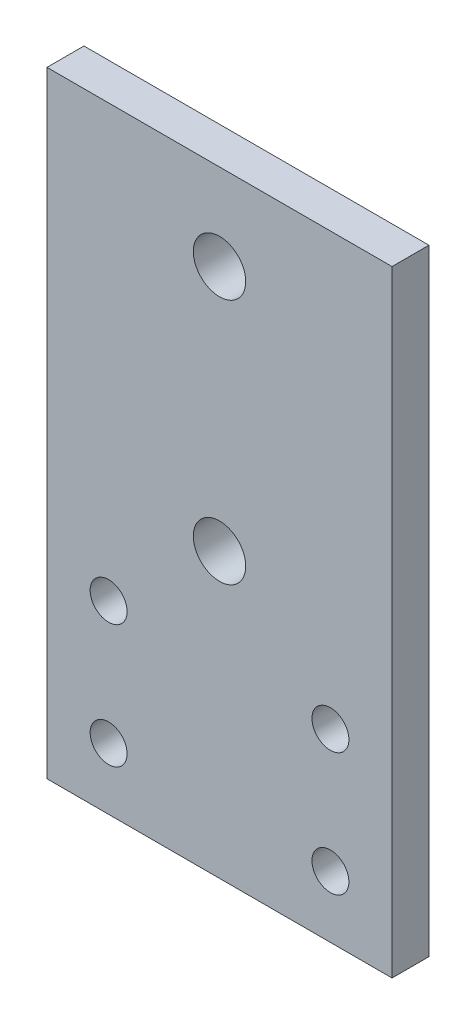
ISO-10303-21;
HEADER;
FILE_DESCRIPTION(('STEP AP214'),'2;1');
FILE_NAME('part.step','',(''),(''),'','','');
FILE_SCHEMA(('AUTOMOTIVE_DESIGN { 1 0 10303 214 1 1 1 1 }'));
ENDSEC;
DATA;
#1=APPLICATION_CONTEXT('core data for automotive mechanical design processes');
#2=APPLICATION_PROTOCOL_DEFINITION('international standard','automotive_design',2000,#1);
#3=PRODUCT_CONTEXT('',#1,'mechanical');
#4=PRODUCT('Part','Part','',(#3));
#5=PRODUCT_RELATED_PRODUCT_CATEGORY('part','',(#4));
#6=PRODUCT_DEFINITION_FORMATION('','',#4);
#7=PRODUCT_DEFINITION_CONTEXT('part definition',#1,'design');
#8=PRODUCT_DEFINITION('design','',#6,#7);
#9=PRODUCT_DEFINITION_SHAPE('','',#8);
#10=(LENGTH_UNIT() NAMED_UNIT(*) SI_UNIT(.MILLI.,.METRE.));
#11=(NAMED_UNIT(*) PLANE_ANGLE_UNIT() SI_UNIT($,.RADIAN.));
#12=(NAMED_UNIT(*) SI_UNIT($,.STERADIAN.) SOLID_ANGLE_UNIT());
#13=UNCERTAINTY_MEASURE_WITH_UNIT(LENGTH_MEASURE(1.E-05),#10,'distance_accuracy_value','');
#14=(GEOMETRIC_REPRESENTATION_CONTEXT(3) GLOBAL_UNCERTAINTY_ASSIGNED_CONTEXT((#13)) GLOBAL_UNIT_ASSIGNED_CONTEXT((#10,
#11,#12)) REPRESENTATION_CONTEXT('',''));
#15=CARTESIAN_POINT('',(0.,0.,0.));
#16=DIRECTION('',(0.,0.,1.));
#17=DIRECTION('',(1.,0.,0.));
#18=AXIS2_PLACEMENT_3D('',#15,#16,#17);
#19=CARTESIAN_POINT('',(0.,0.,3.));
#20=DIRECTION('',(0.,0.,-1.));
#21=DIRECTION('',(-1.,0.,0.));
#22=AXIS2_PLACEMENT_3D('',#19,#20,#21);
#23=PLANE('',#22);
#24=DIRECTION('',(0.,1.,0.));
#25=VECTOR('',#24,1.);
#26=CARTESIAN_POINT('',(14.,-25.,3.));
#27=LINE('',#26,#25);
#28=CARTESIAN_POINT('',(14.,-25.,3.));
#29=VERTEX_POINT('',#28);
#30=CARTESIAN_POINT('',(14.,25.,3.));
#31=VERTEX_POINT('',#30);
#32=EDGE_CURVE('E85',#29,#31,#27,.T.);
#33=ORIENTED_EDGE('',*,*,#32,.T.);
#34=DIRECTION('',(-1.,0.,0.));
#35=VECTOR('',#34,1.);
#36=CARTESIAN_POINT('',(-14.,25.,3.));
#37=LINE('',#36,#35);
#38=CARTESIAN_POINT('',(-14.,25.,3.));
#39=VERTEX_POINT('',#38);
#40=EDGE_CURVE('E80',#31,#39,#37,.T.);
#41=ORIENTED_EDGE('',*,*,#40,.T.);
#42=DIRECTION('',(0.,-1.,0.));
#43=VECTOR('',#42,1.);
#44=CARTESIAN_POINT('',(-14.,-25.,3.));
#45=LINE('',#44,#43);
#46=CARTESIAN_POINT('',(-14.,-25.,3.));
#47=VERTEX_POINT('',#46);
#48=EDGE_CURVE('E83',#39,#47,#45,.T.);
#49=ORIENTED_EDGE('',*,*,#48,.T.);
#50=DIRECTION('',(1.,0.,0.));
#51=VECTOR('',#50,1.);
#52=CARTESIAN_POINT('',(-14.,-25.,3.));
#53=LINE('',#52,#51);
#54=EDGE_CURVE('E50',#47,#29,#53,.T.);
#55=ORIENTED_EDGE('',*,*,#54,.T.);
#56=EDGE_LOOP('',(#33,#41,#49,#55));
#57=FACE_BOUND('',#56,.T.);
#58=CARTESIAN_POINT('',(0.,18.,3.));
#59=DIRECTION('',(0.,0.,1.));
#60=DIRECTION('',(1.,0.,0.));
#61=AXIS2_PLACEMENT_3D('',#58,#59,#60);
#62=CIRCLE('',#61,2.125);
#63=CARTESIAN_POINT('',(2.125,18.,3.));
#64=VERTEX_POINT('',#63);
#65=EDGE_CURVE('E100',#64,#64,#62,.T.);
#66=ORIENTED_EDGE('',*,*,#65,.F.);
#67=EDGE_LOOP('',(#66));
#68=FACE_BOUND('',#67,.T.);
#69=CARTESIAN_POINT('',(0.,-1.99999999999999,3.));
#70=DIRECTION('',(0.,0.,1.));
#71=DIRECTION('',(1.,0.,0.));
#72=AXIS2_PLACEMENT_3D('',#69,#70,#71);
#73=CIRCLE('',#72,2.125);
#74=CARTESIAN_POINT('',(2.125,-1.99999999999999,3.));
#75=VERTEX_POINT('',#74);
#76=EDGE_CURVE('E115',#75,#75,#73,.T.);
#77=ORIENTED_EDGE('',*,*,#76,.F.);
#78=EDGE_LOOP('',(#77));
#79=FACE_BOUND('',#78,.T.);
#80=CARTESIAN_POINT('',(-8.99999999999999,-10.,3.));
#81=DIRECTION('',(0.,0.,1.));
#82=DIRECTION('',(1.,0.,0.));
#83=AXIS2_PLACEMENT_3D('',#80,#81,#82);
#84=CIRCLE('',#83,1.5);
#85=CARTESIAN_POINT('',(-7.49999999999999,-10.,3.));
#86=VERTEX_POINT('',#85);
#87=EDGE_CURVE('E121',#86,#86,#84,.T.);
#88=ORIENTED_EDGE('',*,*,#87,.F.);
#89=EDGE_LOOP('',(#88));
#90=FACE_BOUND('',#89,.T.);
#91=CARTESIAN_POINT('',(-8.99999999999999,-20.,3.));
#92=DIRECTION('',(0.,0.,1.));
#93=DIRECTION('',(1.,0.,0.));
#94=AXIS2_PLACEMENT_3D('',#91,#92,#93);
#95=CIRCLE('',#94,1.5);
#96=CARTESIAN_POINT('',(-7.49999999999999,-20.,3.));
#97=VERTEX_POINT('',#96);
#98=EDGE_CURVE('E127',#97,#97,#95,.T.);
#99=ORIENTED_EDGE('',*,*,#98,.F.);
#100=EDGE_LOOP('',(#99));
#101=FACE_BOUND('',#100,.T.);
#102=CARTESIAN_POINT('',(9.,-20.,3.));
#103=DIRECTION('',(0.,0.,1.));
#104=DIRECTION('',(-1.,0.,0.));
#105=AXIS2_PLACEMENT_3D('',#102,#103,#104);
#106=CIRCLE('',#105,1.5);
#107=CARTESIAN_POINT('',(7.5,-20.,3.));
#108=VERTEX_POINT('',#107);
#109=EDGE_CURVE('E133',#108,#108,#106,.T.);
#110=ORIENTED_EDGE('',*,*,#109,.F.);
#111=EDGE_LOOP('',(#110));
#112=FACE_BOUND('',#111,.T.);
#113=CARTESIAN_POINT('',(9.,-10.,3.));
#114=DIRECTION('',(0.,0.,1.));
#115=DIRECTION('',(-1.,0.,0.));
#116=AXIS2_PLACEMENT_3D('',#113,#114,#115);
#117=CIRCLE('',#116,1.5);
#118=CARTESIAN_POINT('',(7.5,-10.,3.));
#119=VERTEX_POINT('',#118);
#120=EDGE_CURVE('E139',#119,#119,#117,.T.);
#121=ORIENTED_EDGE('',*,*,#120,.F.);
#122=EDGE_LOOP('',(#121));
#123=FACE_BOUND('',#122,.T.);
#124=ADVANCED_FACE('F33',(#57,#68,#79,#90,#101,#112,#123),#23,.F.);
#125=CARTESIAN_POINT('',(0.,0.,0.));
#126=DIRECTION('',(0.,0.,-1.));
#127=DIRECTION('',(-1.,0.,0.));
#128=AXIS2_PLACEMENT_3D('',#125,#126,#127);
#129=PLANE('',#128);
#130=CARTESIAN_POINT('',(9.,-20.,0.));
#131=DIRECTION('',(0.,0.,1.));
#132=DIRECTION('',(-1.,0.,0.));
#133=AXIS2_PLACEMENT_3D('',#130,#131,#132);
#134=CIRCLE('',#133,1.5);
#135=CARTESIAN_POINT('',(7.5,-20.,0.));
#136=VERTEX_POINT('',#135);
#137=EDGE_CURVE('E136',#136,#136,#134,.T.);
#138=ORIENTED_EDGE('',*,*,#137,.T.);
#139=EDGE_LOOP('',(#138));
#140=FACE_BOUND('',#139,.T.);
#141=CARTESIAN_POINT('',(-8.99999999999999,-10.,0.));
#142=DIRECTION('',(0.,0.,1.));
#143=DIRECTION('',(1.,0.,0.));
#144=AXIS2_PLACEMENT_3D('',#141,#142,#143);
#145=CIRCLE('',#144,1.5);
#146=CARTESIAN_POINT('',(-7.49999999999999,-10.,0.));
#147=VERTEX_POINT('',#146);
#148=EDGE_CURVE('E124',#147,#147,#145,.T.);
#149=ORIENTED_EDGE('',*,*,#148,.T.);
#150=EDGE_LOOP('',(#149));
#151=FACE_BOUND('',#150,.T.);
#152=CARTESIAN_POINT('',(0.,18.,0.));
#153=DIRECTION('',(0.,0.,1.));
#154=DIRECTION('',(1.,0.,0.));
#155=AXIS2_PLACEMENT_3D('',#152,#153,#154);
#156=CIRCLE('',#155,2.125);
#157=CARTESIAN_POINT('',(2.125,18.,0.));
#158=VERTEX_POINT('',#157);
#159=EDGE_CURVE('E112',#158,#158,#156,.T.);
#160=ORIENTED_EDGE('',*,*,#159,.T.);
#161=EDGE_LOOP('',(#160));
#162=FACE_BOUND('',#161,.T.);
#163=DIRECTION('',(0.,1.,0.));
#164=VECTOR('',#163,1.);
#165=CARTESIAN_POINT('',(14.,-25.,0.));
#166=LINE('',#165,#164);
#167=CARTESIAN_POINT('',(14.,-25.,0.));
#168=VERTEX_POINT('',#167);
#169=CARTESIAN_POINT('',(14.,25.,0.));
#170=VERTEX_POINT('',#169);
#171=EDGE_CURVE('E97',#168,#170,#166,.T.);
#172=ORIENTED_EDGE('',*,*,#171,.F.);
#173=DIRECTION('',(1.,0.,0.));
#174=VECTOR('',#173,1.);
#175=CARTESIAN_POINT('',(-14.,-25.,0.));
#176=LINE('',#175,#174);
#177=CARTESIAN_POINT('',(-14.,-25.,0.));
#178=VERTEX_POINT('',#177);
#179=EDGE_CURVE('E73',#178,#168,#176,.T.);
#180=ORIENTED_EDGE('',*,*,#179,.F.);
#181=DIRECTION('',(0.,-1.,0.));
#182=VECTOR('',#181,1.);
#183=CARTESIAN_POINT('',(-14.,-25.,0.));
#184=LINE('',#183,#182);
#185=CARTESIAN_POINT('',(-14.,25.,0.));
#186=VERTEX_POINT('',#185);
#187=EDGE_CURVE('E67',#186,#178,#184,.T.);
#188=ORIENTED_EDGE('',*,*,#187,.F.);
#189=DIRECTION('',(-1.,0.,0.));
#190=VECTOR('',#189,1.);
#191=CARTESIAN_POINT('',(-14.,25.,0.));
#192=LINE('',#191,#190);
#193=EDGE_CURVE('E89',#170,#186,#192,.T.);
#194=ORIENTED_EDGE('',*,*,#193,.F.);
#195=EDGE_LOOP('',(#172,#180,#188,#194));
#196=FACE_BOUND('',#195,.T.);
#197=CARTESIAN_POINT('',(0.,-1.99999999999999,0.));
#198=DIRECTION('',(0.,0.,1.));
#199=DIRECTION('',(1.,0.,0.));
#200=AXIS2_PLACEMENT_3D('',#197,#198,#199);
#201=CIRCLE('',#200,2.125);
#202=CARTESIAN_POINT('',(2.125,-1.99999999999999,0.));
#203=VERTEX_POINT('',#202);
#204=EDGE_CURVE('E118',#203,#203,#201,.T.);
#205=ORIENTED_EDGE('',*,*,#204,.T.);
#206=EDGE_LOOP('',(#205));
#207=FACE_BOUND('',#206,.T.);
#208=CARTESIAN_POINT('',(-8.99999999999999,-20.,0.));
#209=DIRECTION('',(0.,0.,1.));
#210=DIRECTION('',(1.,0.,0.));
#211=AXIS2_PLACEMENT_3D('',#208,#209,#210);
#212=CIRCLE('',#211,1.5);
#213=CARTESIAN_POINT('',(-7.49999999999999,-20.,0.));
#214=VERTEX_POINT('',#213);
#215=EDGE_CURVE('E130',#214,#214,#212,.T.);
#216=ORIENTED_EDGE('',*,*,#215,.T.);
#217=EDGE_LOOP('',(#216));
#218=FACE_BOUND('',#217,.T.);
#219=CARTESIAN_POINT('',(9.,-10.,0.));
#220=DIRECTION('',(0.,0.,1.));
#221=DIRECTION('',(-1.,0.,0.));
#222=AXIS2_PLACEMENT_3D('',#219,#220,#221);
#223=CIRCLE('',#222,1.5);
#224=CARTESIAN_POINT('',(7.5,-10.,0.));
#225=VERTEX_POINT('',#224);
#226=EDGE_CURVE('E142',#225,#225,#223,.T.);
#227=ORIENTED_EDGE('',*,*,#226,.T.);
#228=EDGE_LOOP('',(#227));
#229=FACE_BOUND('',#228,.T.);
#230=ADVANCED_FACE('F108',(#140,#151,#162,#196,#207,#218,#229),#129,.T.);
#231=CARTESIAN_POINT('',(14.,-25.,3.));
#232=DIRECTION('',(-1.,0.,0.));
#233=DIRECTION('',(0.,0.,1.));
#234=AXIS2_PLACEMENT_3D('',#231,#232,#233);
#235=PLANE('',#234);
#236=ORIENTED_EDGE('',*,*,#171,.T.);
#237=DIRECTION('',(0.,0.,-1.));
#238=VECTOR('',#237,1.);
#239=CARTESIAN_POINT('',(14.,25.,3.));
#240=LINE('',#239,#238);
#241=EDGE_CURVE('E11',#31,#170,#240,.T.);
#242=ORIENTED_EDGE('',*,*,#241,.F.);
#243=ORIENTED_EDGE('',*,*,#32,.F.);
#244=DIRECTION('',(0.,0.,-1.));
#245=VECTOR('',#244,1.);
#246=CARTESIAN_POINT('',(14.,-25.,3.));
#247=LINE('',#246,#245);
#248=EDGE_CURVE('E93',#29,#168,#247,.T.);
#249=ORIENTED_EDGE('',*,*,#248,.T.);
#250=EDGE_LOOP('',(#236,#242,#243,#249));
#251=FACE_BOUND('',#250,.T.);
#252=ADVANCED_FACE('F35',(#251),#235,.F.);
#253=CARTESIAN_POINT('',(-14.,25.,3.));
#254=DIRECTION('',(0.,-1.,0.));
#255=DIRECTION('',(0.,0.,-1.));
#256=AXIS2_PLACEMENT_3D('',#253,#254,#255);
#257=PLANE('',#256);
#258=ORIENTED_EDGE('',*,*,#193,.T.);
#259=DIRECTION('',(0.,0.,-1.));
#260=VECTOR('',#259,1.);
#261=CARTESIAN_POINT('',(-14.,25.,3.));
#262=LINE('',#261,#260);
#263=EDGE_CURVE('E42',#39,#186,#262,.T.);
#264=ORIENTED_EDGE('',*,*,#263,.F.);
#265=ORIENTED_EDGE('',*,*,#40,.F.);
#266=ORIENTED_EDGE('',*,*,#241,.T.);
#267=EDGE_LOOP('',(#258,#264,#265,#266));
#268=FACE_BOUND('',#267,.T.);
#269=ADVANCED_FACE('F88',(#268),#257,.F.);
#270=CARTESIAN_POINT('',(-14.,-25.,3.));
#271=DIRECTION('',(1.,0.,0.));
#272=DIRECTION('',(0.,0.,-1.));
#273=AXIS2_PLACEMENT_3D('',#270,#271,#272);
#274=PLANE('',#273);
#275=ORIENTED_EDGE('',*,*,#187,.T.);
#276=DIRECTION('',(0.,0.,-1.));
#277=VECTOR('',#276,1.);
#278=CARTESIAN_POINT('',(-14.,-25.,3.));
#279=LINE('',#278,#277);
#280=EDGE_CURVE('E90',#47,#178,#279,.T.);
#281=ORIENTED_EDGE('',*,*,#280,.F.);
#282=ORIENTED_EDGE('',*,*,#48,.F.);
#283=ORIENTED_EDGE('',*,*,#263,.T.);
#284=EDGE_LOOP('',(#275,#281,#282,#283));
#285=FACE_BOUND('',#284,.T.);
#286=ADVANCED_FACE('F91',(#285),#274,.F.);
#287=CARTESIAN_POINT('',(-14.,-25.,3.));
#288=DIRECTION('',(0.,1.,0.));
#289=DIRECTION('',(0.,0.,1.));
#290=AXIS2_PLACEMENT_3D('',#287,#288,#289);
#291=PLANE('',#290);
#292=ORIENTED_EDGE('',*,*,#179,.T.);
#293=ORIENTED_EDGE('',*,*,#248,.F.);
#294=ORIENTED_EDGE('',*,*,#54,.F.);
#295=ORIENTED_EDGE('',*,*,#280,.T.);
#296=EDGE_LOOP('',(#292,#293,#294,#295));
#297=FACE_BOUND('',#296,.T.);
#298=ADVANCED_FACE('F105',(#297),#291,.F.);
#299=CARTESIAN_POINT('',(0.,18.,3.));
#300=DIRECTION('',(0.,0.,-1.));
#301=DIRECTION('',(-1.,0.,0.));
#302=AXIS2_PLACEMENT_3D('',#299,#300,#301);
#303=CYLINDRICAL_SURFACE('',#302,2.125);
#304=ORIENTED_EDGE('',*,*,#65,.T.);
#305=EDGE_LOOP('',(#304));
#306=FACE_BOUND('',#305,.T.);
#307=ORIENTED_EDGE('',*,*,#159,.F.);
#308=EDGE_LOOP('',(#307));
#309=FACE_BOUND('',#308,.T.);
#310=ADVANCED_FACE('F159',(#306,#309),#303,.F.);
#311=CARTESIAN_POINT('',(0.,-1.99999999999999,3.));
#312=DIRECTION('',(0.,0.,-1.));
#313=DIRECTION('',(-1.,0.,0.));
#314=AXIS2_PLACEMENT_3D('',#311,#312,#313);
#315=CYLINDRICAL_SURFACE('',#314,2.125);
#316=ORIENTED_EDGE('',*,*,#76,.T.);
#317=EDGE_LOOP('',(#316));
#318=FACE_BOUND('',#317,.T.);
#319=ORIENTED_EDGE('',*,*,#204,.F.);
#320=EDGE_LOOP('',(#319));
#321=FACE_BOUND('',#320,.T.);
#322=ADVANCED_FACE('F205',(#318,#321),#315,.F.);
#323=CARTESIAN_POINT('',(-8.99999999999999,-10.,3.));
#324=DIRECTION('',(0.,0.,-1.));
#325=DIRECTION('',(-1.,0.,0.));
#326=AXIS2_PLACEMENT_3D('',#323,#324,#325);
#327=CYLINDRICAL_SURFACE('',#326,1.5);
#328=ORIENTED_EDGE('',*,*,#87,.T.);
#329=EDGE_LOOP('',(#328));
#330=FACE_BOUND('',#329,.T.);
#331=ORIENTED_EDGE('',*,*,#148,.F.);
#332=EDGE_LOOP('',(#331));
#333=FACE_BOUND('',#332,.T.);
#334=ADVANCED_FACE('F213',(#330,#333),#327,.F.);
#335=CARTESIAN_POINT('',(-8.99999999999999,-20.,3.));
#336=DIRECTION('',(0.,0.,-1.));
#337=DIRECTION('',(-1.,0.,0.));
#338=AXIS2_PLACEMENT_3D('',#335,#336,#337);
#339=CYLINDRICAL_SURFACE('',#338,1.5);
#340=ORIENTED_EDGE('',*,*,#98,.T.);
#341=EDGE_LOOP('',(#340));
#342=FACE_BOUND('',#341,.T.);
#343=ORIENTED_EDGE('',*,*,#215,.F.);
#344=EDGE_LOOP('',(#343));
#345=FACE_BOUND('',#344,.T.);
#346=ADVANCED_FACE('F221',(#342,#345),#339,.F.);
#347=CARTESIAN_POINT('',(9.,-20.,3.));
#348=DIRECTION('',(0.,0.,-1.));
#349=DIRECTION('',(-1.,0.,0.));
#350=AXIS2_PLACEMENT_3D('',#347,#348,#349);
#351=CYLINDRICAL_SURFACE('',#350,1.5);
#352=ORIENTED_EDGE('',*,*,#109,.T.);
#353=EDGE_LOOP('',(#352));
#354=FACE_BOUND('',#353,.T.);
#355=ORIENTED_EDGE('',*,*,#137,.F.);
#356=EDGE_LOOP('',(#355));
#357=FACE_BOUND('',#356,.T.);
#358=ADVANCED_FACE('F230',(#354,#357),#351,.F.);
#359=CARTESIAN_POINT('',(9.,-10.,3.));
#360=DIRECTION('',(0.,0.,-1.));
#361=DIRECTION('',(-1.,0.,0.));
#362=AXIS2_PLACEMENT_3D('',#359,#360,#361);
#363=CYLINDRICAL_SURFACE('',#362,1.5);
#364=ORIENTED_EDGE('',*,*,#120,.T.);
#365=EDGE_LOOP('',(#364));
#366=FACE_BOUND('',#365,.T.);
#367=ORIENTED_EDGE('',*,*,#226,.F.);
#368=EDGE_LOOP('',(#367));
#369=FACE_BOUND('',#368,.T.);
#370=ADVANCED_FACE('F148',(#366,#369),#363,.F.);
#371=CLOSED_SHELL('',(#124,#230,#252,#269,#286,#298,#310,#322,#334,#346,#358,#370));
#372=MANIFOLD_SOLID_BREP('B2',#371);
#373=ADVANCED_BREP_SHAPE_REPRESENTATION('',(#18,#372),#14);
#374=SHAPE_DEFINITION_REPRESENTATION(#9,#373);
ENDSEC;
END-ISO-10303-21;
